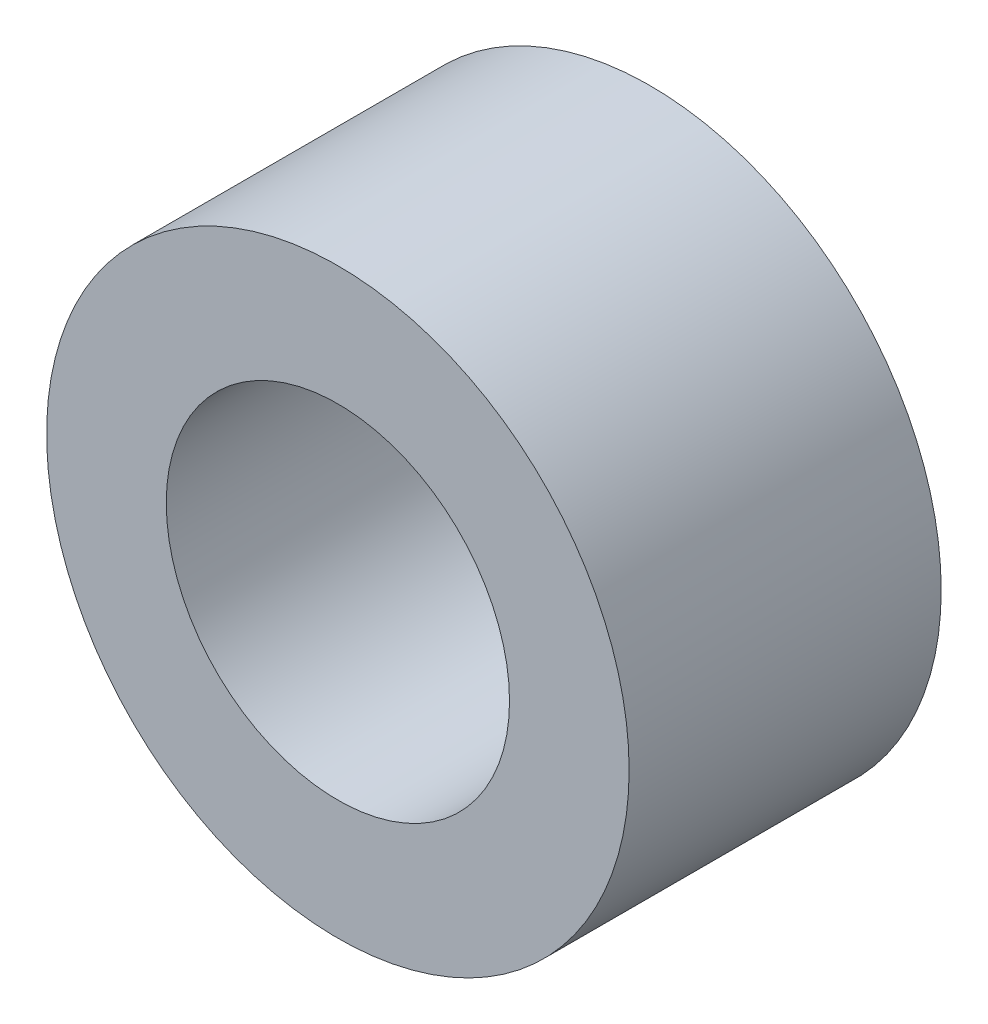
ISO-10303-21;
HEADER;
FILE_DESCRIPTION(('STEP AP214'),'2;1');
FILE_NAME('part.step','',(''),(''),'','','');
FILE_SCHEMA(('AUTOMOTIVE_DESIGN { 1 0 10303 214 1 1 1 1 }'));
ENDSEC;
DATA;
#1=APPLICATION_CONTEXT('core data for automotive mechanical design processes');
#2=APPLICATION_PROTOCOL_DEFINITION('international standard','automotive_design',2000,#1);
#3=PRODUCT_CONTEXT('',#1,'mechanical');
#4=PRODUCT('Part','Part','',(#3));
#5=PRODUCT_RELATED_PRODUCT_CATEGORY('part','',(#4));
#6=PRODUCT_DEFINITION_FORMATION('','',#4);
#7=PRODUCT_DEFINITION_CONTEXT('part definition',#1,'design');
#8=PRODUCT_DEFINITION('design','',#6,#7);
#9=PRODUCT_DEFINITION_SHAPE('','',#8);
#10=(LENGTH_UNIT() NAMED_UNIT(*) SI_UNIT(.MILLI.,.METRE.));
#11=(NAMED_UNIT(*) PLANE_ANGLE_UNIT() SI_UNIT($,.RADIAN.));
#12=(NAMED_UNIT(*) SI_UNIT($,.STERADIAN.) SOLID_ANGLE_UNIT());
#13=UNCERTAINTY_MEASURE_WITH_UNIT(LENGTH_MEASURE(1.E-05),#10,'distance_accuracy_value','');
#14=(GEOMETRIC_REPRESENTATION_CONTEXT(3) GLOBAL_UNCERTAINTY_ASSIGNED_CONTEXT((#13)) GLOBAL_UNIT_ASSIGNED_CONTEXT((#10,
#11,#12)) REPRESENTATION_CONTEXT('',''));
#15=CARTESIAN_POINT('',(0.,0.,0.));
#16=DIRECTION('',(0.,0.,1.));
#17=DIRECTION('',(1.,0.,0.));
#18=AXIS2_PLACEMENT_3D('',#15,#16,#17);
#19=CARTESIAN_POINT('',(0.,0.,3.));
#20=DIRECTION('',(0.,0.,1.));
#21=DIRECTION('',(1.,0.,0.));
#22=AXIS2_PLACEMENT_3D('',#19,#20,#21);
#23=PLANE('',#22);
#24=CARTESIAN_POINT('',(0.,0.,3.));
#25=DIRECTION('',(0.,0.,1.));
#26=DIRECTION('',(1.,0.,0.));
#27=AXIS2_PLACEMENT_3D('',#24,#25,#26);
#28=CIRCLE('',#27,2.8);
#29=CARTESIAN_POINT('',(2.8,0.,3.));
#30=VERTEX_POINT('',#29);
#31=EDGE_CURVE('E10',#30,#30,#28,.T.);
#32=ORIENTED_EDGE('',*,*,#31,.T.);
#33=EDGE_LOOP('',(#32));
#34=FACE_BOUND('',#33,.T.);
#35=CARTESIAN_POINT('',(0.,0.,3.));
#36=DIRECTION('',(0.,0.,1.));
#37=DIRECTION('',(1.,0.,0.));
#38=AXIS2_PLACEMENT_3D('',#35,#36,#37);
#39=CIRCLE('',#38,1.65);
#40=CARTESIAN_POINT('',(1.65,0.,3.));
#41=VERTEX_POINT('',#40);
#42=EDGE_CURVE('E50',#41,#41,#39,.T.);
#43=ORIENTED_EDGE('',*,*,#42,.F.);
#44=EDGE_LOOP('',(#43));
#45=FACE_BOUND('',#44,.T.);
#46=ADVANCED_FACE('F37',(#34,#45),#23,.T.);
#47=CARTESIAN_POINT('',(0.,0.,0.));
#48=DIRECTION('',(0.,0.,1.));
#49=DIRECTION('',(1.,0.,0.));
#50=AXIS2_PLACEMENT_3D('',#47,#48,#49);
#51=PLANE('',#50);
#52=CARTESIAN_POINT('',(0.,0.,0.));
#53=DIRECTION('',(0.,0.,1.));
#54=DIRECTION('',(1.,0.,0.));
#55=AXIS2_PLACEMENT_3D('',#52,#53,#54);
#56=CIRCLE('',#55,2.8);
#57=CARTESIAN_POINT('',(2.8,0.,0.));
#58=VERTEX_POINT('',#57);
#59=EDGE_CURVE('E41',#58,#58,#56,.T.);
#60=ORIENTED_EDGE('',*,*,#59,.F.);
#61=EDGE_LOOP('',(#60));
#62=FACE_BOUND('',#61,.T.);
#63=CARTESIAN_POINT('',(0.,0.,0.));
#64=DIRECTION('',(0.,0.,1.));
#65=DIRECTION('',(1.,0.,0.));
#66=AXIS2_PLACEMENT_3D('',#63,#64,#65);
#67=CIRCLE('',#66,1.65);
#68=CARTESIAN_POINT('',(1.65,0.,0.));
#69=VERTEX_POINT('',#68);
#70=EDGE_CURVE('E52',#69,#69,#67,.T.);
#71=ORIENTED_EDGE('',*,*,#70,.T.);
#72=EDGE_LOOP('',(#71));
#73=FACE_BOUND('',#72,.T.);
#74=ADVANCED_FACE('F64',(#62,#73),#51,.F.);
#75=CARTESIAN_POINT('',(0.,0.,3.));
#76=DIRECTION('',(0.,0.,-1.));
#77=DIRECTION('',(-1.,0.,0.));
#78=AXIS2_PLACEMENT_3D('',#75,#76,#77);
#79=CYLINDRICAL_SURFACE('',#78,2.8);
#80=ORIENTED_EDGE('',*,*,#31,.F.);
#81=EDGE_LOOP('',(#80));
#82=FACE_BOUND('',#81,.T.);
#83=ORIENTED_EDGE('',*,*,#59,.T.);
#84=EDGE_LOOP('',(#83));
#85=FACE_BOUND('',#84,.T.);
#86=ADVANCED_FACE('F39',(#82,#85),#79,.T.);
#87=CARTESIAN_POINT('',(0.,0.,3.));
#88=DIRECTION('',(0.,0.,-1.));
#89=DIRECTION('',(-1.,0.,0.));
#90=AXIS2_PLACEMENT_3D('',#87,#88,#89);
#91=CYLINDRICAL_SURFACE('',#90,1.65);
#92=ORIENTED_EDGE('',*,*,#42,.T.);
#93=EDGE_LOOP('',(#92));
#94=FACE_BOUND('',#93,.T.);
#95=ORIENTED_EDGE('',*,*,#70,.F.);
#96=EDGE_LOOP('',(#95));
#97=FACE_BOUND('',#96,.T.);
#98=ADVANCED_FACE('F60',(#94,#97),#91,.F.);
#99=CLOSED_SHELL('',(#46,#74,#86,#98));
#100=MANIFOLD_SOLID_BREP('B2',#99);
#101=ADVANCED_BREP_SHAPE_REPRESENTATION('',(#18,#100),#14);
#102=SHAPE_DEFINITION_REPRESENTATION(#9,#101);
ENDSEC;
END-ISO-10303-21;
